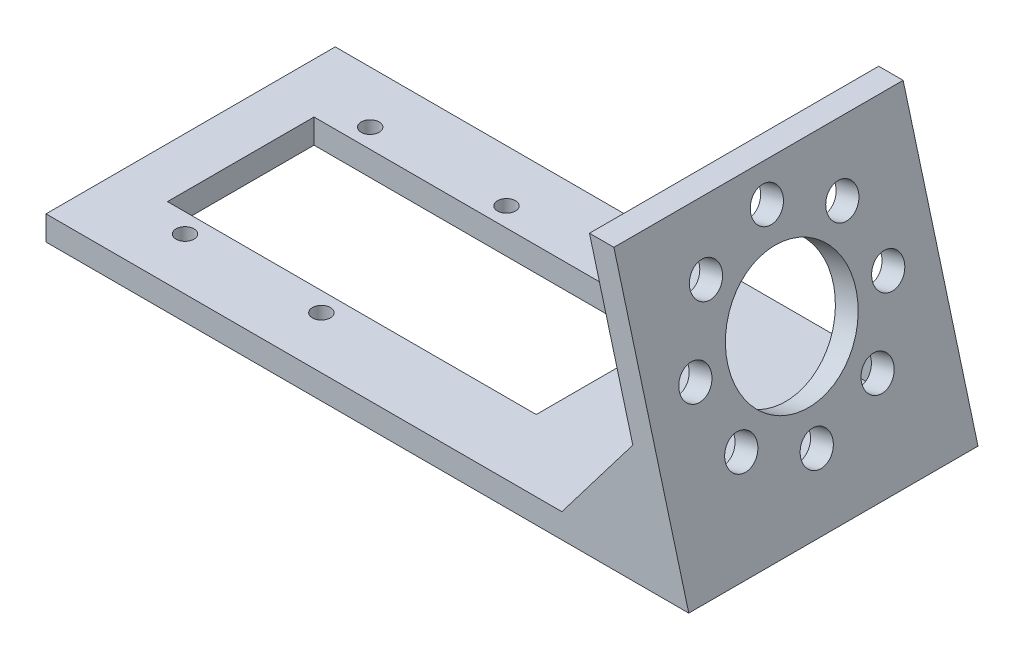
ISO-10303-21;
HEADER;
FILE_DESCRIPTION(('STEP AP214'),'2;1');
FILE_NAME('part.step','',(''),(''),'','','');
FILE_SCHEMA(('AUTOMOTIVE_DESIGN { 1 0 10303 214 1 1 1 1 }'));
ENDSEC;
DATA;
#1=APPLICATION_CONTEXT('core data for automotive mechanical design processes');
#2=APPLICATION_PROTOCOL_DEFINITION('international standard','automotive_design',2000,#1);
#3=PRODUCT_CONTEXT('',#1,'mechanical');
#4=PRODUCT('Part','Part','',(#3));
#5=PRODUCT_RELATED_PRODUCT_CATEGORY('part','',(#4));
#6=PRODUCT_DEFINITION_FORMATION('','',#4);
#7=PRODUCT_DEFINITION_CONTEXT('part definition',#1,'design');
#8=PRODUCT_DEFINITION('design','',#6,#7);
#9=PRODUCT_DEFINITION_SHAPE('','',#8);
#10=(LENGTH_UNIT() NAMED_UNIT(*) SI_UNIT(.MILLI.,.METRE.));
#11=(NAMED_UNIT(*) PLANE_ANGLE_UNIT() SI_UNIT($,.RADIAN.));
#12=(NAMED_UNIT(*) SI_UNIT($,.STERADIAN.) SOLID_ANGLE_UNIT());
#13=UNCERTAINTY_MEASURE_WITH_UNIT(LENGTH_MEASURE(1.E-05),#10,'distance_accuracy_value','');
#14=(GEOMETRIC_REPRESENTATION_CONTEXT(3) GLOBAL_UNCERTAINTY_ASSIGNED_CONTEXT((#13)) GLOBAL_UNIT_ASSIGNED_CONTEXT((#10,
#11,#12)) REPRESENTATION_CONTEXT('',''));
#15=CARTESIAN_POINT('',(0.,0.,0.));
#16=DIRECTION('',(0.,0.,1.));
#17=DIRECTION('',(1.,0.,0.));
#18=AXIS2_PLACEMENT_3D('',#15,#16,#17);
#19=CARTESIAN_POINT('',(57.6024915723907,55.2026609724202,57.15));
#20=DIRECTION('',(0.965925826289067,0.258819045102525,0.));
#21=DIRECTION('',(-0.258819045102525,0.965925826289067,0.));
#22=AXIS2_PLACEMENT_3D('',#19,#20,#21);
#23=PLANE('',#22);
#24=CARTESIAN_POINT('',(64.499776018663,29.4616449846778,47.625));
#25=DIRECTION('',(0.965925826289067,0.258819045102525,0.));
#26=DIRECTION('',(0.,0.,1.));
#27=AXIS2_PLACEMENT_3D('',#24,#25,#26);
#28=CIRCLE('',#27,3.175);
#29=CARTESIAN_POINT('',(64.499776018663,29.4616449846778,50.8));
#30=VERTEX_POINT('',#29);
#31=EDGE_CURVE('E208',#30,#30,#28,.F.);
#32=ORIENTED_EDGE('',*,*,#31,.F.);
#33=EDGE_LOOP('',(#32));
#34=FACE_BOUND('',#33,.T.);
#35=CARTESIAN_POINT('',(67.9861679897098,16.4502530136311,42.0453841816037));
#36=DIRECTION('',(0.965925826289067,0.258819045102526,0.));
#37=DIRECTION('',(0.183012701892224,-0.683012701892222,0.707106781186544));
#38=AXIS2_PLACEMENT_3D('',#35,#36,#37);
#39=CIRCLE('',#38,3.175);
#40=CARTESIAN_POINT('',(68.5672333182176,14.2816876851233,44.2904482118709));
#41=VERTEX_POINT('',#40);
#42=EDGE_CURVE('E209',#41,#41,#39,.F.);
#43=ORIENTED_EDGE('',*,*,#42,.F.);
#44=EDGE_LOOP('',(#43));
#45=FACE_BOUND('',#44,.T.);
#46=CARTESIAN_POINT('',(69.4302788278661,11.0607579938712,28.575));
#47=DIRECTION('',(0.965925826289067,0.258819045102526,0.));
#48=DIRECTION('',(0.258819045102526,-0.965925826289067,0.));
#49=AXIS2_PLACEMENT_3D('',#46,#47,#48);
#50=CIRCLE('',#49,3.175);
#51=CARTESIAN_POINT('',(70.2520292960666,7.99394349540337,28.575));
#52=VERTEX_POINT('',#51);
#53=EDGE_CURVE('E216',#52,#52,#50,.F.);
#54=ORIENTED_EDGE('',*,*,#53,.F.);
#55=EDGE_LOOP('',(#54));
#56=FACE_BOUND('',#55,.T.);
#57=CARTESIAN_POINT('',(67.9861679897098,16.4502530136312,15.1046158183961));
#58=DIRECTION('',(0.965925826289067,0.258819045102526,0.));
#59=DIRECTION('',(0.183012701892221,-0.683012701892212,-0.707106781186554));
#60=AXIS2_PLACEMENT_3D('',#57,#58,#59);
#61=CIRCLE('',#60,3.175);
#62=CARTESIAN_POINT('',(68.5672333182176,14.2816876851235,12.8595517881288));
#63=VERTEX_POINT('',#62);
#64=EDGE_CURVE('E222',#63,#63,#61,.F.);
#65=ORIENTED_EDGE('',*,*,#64,.F.);
#66=EDGE_LOOP('',(#65));
#67=FACE_BOUND('',#66,.T.);
#68=CARTESIAN_POINT('',(64.4997760186629,29.4616449846781,9.52499999999998));
#69=DIRECTION('',(0.965925826289067,0.258819045102525,0.));
#70=DIRECTION('',(0.,0.,-1.));
#71=AXIS2_PLACEMENT_3D('',#68,#69,#70);
#72=CIRCLE('',#71,3.175);
#73=CARTESIAN_POINT('',(64.4997760186629,29.4616449846781,6.34999999999998));
#74=VERTEX_POINT('',#73);
#75=EDGE_CURVE('E196',#74,#74,#72,.F.);
#76=ORIENTED_EDGE('',*,*,#75,.F.);
#77=EDGE_LOOP('',(#76));
#78=FACE_BOUND('',#77,.T.);
#79=CARTESIAN_POINT('',(61.0133840476161,42.4730369557248,15.1046158183964));
#80=DIRECTION('',(0.965925826289067,0.258819045102525,0.));
#81=DIRECTION('',(-0.183012701892224,0.683012701892227,-0.707106781186539));
#82=AXIS2_PLACEMENT_3D('',#79,#80,#81);
#83=CIRCLE('',#82,3.175);
#84=CARTESIAN_POINT('',(60.4323187191083,44.6416022842326,12.8595517881292));
#85=VERTEX_POINT('',#84);
#86=EDGE_CURVE('E197',#85,#85,#83,.F.);
#87=ORIENTED_EDGE('',*,*,#86,.F.);
#88=EDGE_LOOP('',(#87));
#89=FACE_BOUND('',#88,.T.);
#90=CARTESIAN_POINT('',(61.0133840476161,42.4730369557246,42.0453841816038));
#91=DIRECTION('',(0.965925826289067,0.258819045102525,0.));
#92=DIRECTION('',(-0.183012701892222,0.683012701892218,0.707106781186549));
#93=AXIS2_PLACEMENT_3D('',#90,#91,#92);
#94=CIRCLE('',#93,3.175);
#95=CARTESIAN_POINT('',(60.4323187191083,44.6416022842324,44.2904482118711));
#96=VERTEX_POINT('',#95);
#97=EDGE_CURVE('E231',#96,#96,#94,.F.);
#98=ORIENTED_EDGE('',*,*,#97,.F.);
#99=EDGE_LOOP('',(#98));
#100=FACE_BOUND('',#99,.T.);
#101=CARTESIAN_POINT('',(59.5692732094599,47.8625319754846,28.575));
#102=DIRECTION('',(0.965925826289067,0.258819045102525,0.));
#103=DIRECTION('',(-0.258819045102525,0.965925826289067,0.));
#104=AXIS2_PLACEMENT_3D('',#101,#102,#103);
#105=CIRCLE('',#104,3.175);
#106=CARTESIAN_POINT('',(58.7475227412593,50.9293464739524,28.575));
#107=VERTEX_POINT('',#106);
#108=EDGE_CURVE('E237',#107,#107,#105,.F.);
#109=ORIENTED_EDGE('',*,*,#108,.F.);
#110=EDGE_LOOP('',(#109));
#111=FACE_BOUND('',#110,.T.);
#112=CARTESIAN_POINT('',(64.499776018663,29.4616449846779,28.575));
#113=DIRECTION('',(0.965925826289067,0.258819045102525,0.));
#114=DIRECTION('',(-0.258819045102525,0.965925826289067,0.));
#115=AXIS2_PLACEMENT_3D('',#112,#113,#114);
#116=CIRCLE('',#115,12.7);
#117=CARTESIAN_POINT('',(61.2127741458609,41.7289029785491,28.575));
#118=VERTEX_POINT('',#117);
#119=EDGE_CURVE('E241',#118,#118,#116,.F.);
#120=ORIENTED_EDGE('',*,*,#119,.F.);
#121=EDGE_LOOP('',(#120));
#122=FACE_BOUND('',#121,.T.);
#123=DIRECTION('',(0.258819045102525,-0.965925826289067,0.));
#124=VECTOR('',#123,1.);
#125=CARTESIAN_POINT('',(57.6024915723907,55.2026609724202,0.));
#126=LINE('',#125,#124);
#127=CARTESIAN_POINT('',(57.6024915723907,55.2026609724202,0.));
#128=VERTEX_POINT('',#127);
#129=CARTESIAN_POINT('',(66.1703743881243,23.2268869908067,0.));
#130=VERTEX_POINT('',#129);
#131=EDGE_CURVE('E300',#128,#130,#126,.T.);
#132=ORIENTED_EDGE('',*,*,#131,.T.);
#133=DIRECTION('',(0.,0.,-1.));
#134=VECTOR('',#133,1.);
#135=CARTESIAN_POINT('',(66.1703743881243,23.2268869908067,4.82600000000001));
#136=LINE('',#135,#134);
#137=CARTESIAN_POINT('',(66.1703743881243,23.2268869908067,4.82600000000001));
#138=VERTEX_POINT('',#137);
#139=EDGE_CURVE('E254',#138,#130,#136,.T.);
#140=ORIENTED_EDGE('',*,*,#139,.F.);
#141=DIRECTION('',(0.258819045102525,-0.965925826289067,0.));
#142=VECTOR('',#141,1.);
#143=CARTESIAN_POINT('',(67.5445215407852,18.0985000000003,4.82600000000001));
#144=LINE('',#143,#142);
#145=CARTESIAN_POINT('',(71.1008771973273,4.826,4.82600000000001));
#146=VERTEX_POINT('',#145);
#147=EDGE_CURVE('E250',#138,#146,#144,.T.);
#148=ORIENTED_EDGE('',*,*,#147,.T.);
#149=DIRECTION('',(0.,0.,-1.));
#150=VECTOR('',#149,1.);
#151=CARTESIAN_POINT('',(71.1008771973273,4.826,57.15));
#152=LINE('',#151,#150);
#153=CARTESIAN_POINT('',(71.1008771973273,4.826,52.324));
#154=VERTEX_POINT('',#153);
#155=EDGE_CURVE('E305',#154,#146,#152,.T.);
#156=ORIENTED_EDGE('',*,*,#155,.F.);
#157=DIRECTION('',(0.258819045102525,-0.965925826289067,0.));
#158=VECTOR('',#157,1.);
#159=CARTESIAN_POINT('',(67.5445215407852,18.0985000000003,52.324));
#160=LINE('',#159,#158);
#161=CARTESIAN_POINT('',(66.1703743881243,23.2268869908068,52.324));
#162=VERTEX_POINT('',#161);
#163=EDGE_CURVE('E266',#162,#154,#160,.T.);
#164=ORIENTED_EDGE('',*,*,#163,.F.);
#165=DIRECTION('',(0.,0.,1.));
#166=VECTOR('',#165,1.);
#167=CARTESIAN_POINT('',(66.1703743881243,23.2268869908068,52.324));
#168=LINE('',#167,#166);
#169=CARTESIAN_POINT('',(66.1703743881243,23.2268869908068,57.15));
#170=VERTEX_POINT('',#169);
#171=EDGE_CURVE('E270',#162,#170,#168,.T.);
#172=ORIENTED_EDGE('',*,*,#171,.T.);
#173=DIRECTION('',(0.258819045102525,-0.965925826289067,0.));
#174=VECTOR('',#173,1.);
#175=CARTESIAN_POINT('',(57.6024915723907,55.2026609724202,57.15));
#176=LINE('',#175,#174);
#177=CARTESIAN_POINT('',(57.6024915723907,55.2026609724202,57.15));
#178=VERTEX_POINT('',#177);
#179=EDGE_CURVE('E286',#178,#170,#176,.T.);
#180=ORIENTED_EDGE('',*,*,#179,.F.);
#181=DIRECTION('',(0.,0.,-1.));
#182=VECTOR('',#181,1.);
#183=CARTESIAN_POINT('',(57.6024915723907,55.2026609724202,57.15));
#184=LINE('',#183,#182);
#185=EDGE_CURVE('E308',#178,#128,#184,.T.);
#186=ORIENTED_EDGE('',*,*,#185,.T.);
#187=EDGE_LOOP('',(#132,#140,#148,#156,#164,#172,#180,#186));
#188=FACE_BOUND('',#187,.T.);
#189=ADVANCED_FACE('F39',(#34,#45,#56,#67,#78,#89,#100,#111,#122,#188),#23,.F.);
#190=CARTESIAN_POINT('',(71.1008771973273,4.826,57.15));
#191=DIRECTION('',(0.,-1.,0.));
#192=DIRECTION('',(1.,0.,0.));
#193=AXIS2_PLACEMENT_3D('',#190,#191,#192);
#194=PLANE('',#193);
#195=CARTESIAN_POINT('',(-32.595884,4.826,10.287));
#196=DIRECTION('',(0.,-1.,0.));
#197=DIRECTION('',(-1.,0.,0.));
#198=AXIS2_PLACEMENT_3D('',#195,#196,#197);
#199=CIRCLE('',#198,1.778);
#200=CARTESIAN_POINT('',(-34.373884,4.826,10.287));
#201=VERTEX_POINT('',#200);
#202=EDGE_CURVE('E397',#201,#201,#199,.T.);
#203=ORIENTED_EDGE('',*,*,#202,.T.);
#204=EDGE_LOOP('',(#203));
#205=FACE_BOUND('',#204,.T.);
#206=CARTESIAN_POINT('',(-5.65512000000001,4.826,10.287));
#207=DIRECTION('',(0.,-1.,0.));
#208=DIRECTION('',(-1.,0.,0.));
#209=AXIS2_PLACEMENT_3D('',#206,#207,#208);
#210=CIRCLE('',#209,1.778);
#211=CARTESIAN_POINT('',(-7.43312000000001,4.826,10.287));
#212=VERTEX_POINT('',#211);
#213=EDGE_CURVE('E164',#212,#212,#210,.T.);
#214=ORIENTED_EDGE('',*,*,#213,.T.);
#215=EDGE_LOOP('',(#214));
#216=FACE_BOUND('',#215,.T.);
#217=DIRECTION('',(0.,0.,1.));
#218=VECTOR('',#217,1.);
#219=CARTESIAN_POINT('',(-39.874,4.826,43.053));
#220=LINE('',#219,#218);
#221=CARTESIAN_POINT('',(-39.874,4.826,14.097));
#222=VERTEX_POINT('',#221);
#223=CARTESIAN_POINT('',(-39.874,4.826,43.053));
#224=VERTEX_POINT('',#223);
#225=EDGE_CURVE('E170',#222,#224,#220,.T.);
#226=ORIENTED_EDGE('',*,*,#225,.F.);
#227=DIRECTION('',(-1.,0.,0.));
#228=VECTOR('',#227,1.);
#229=CARTESIAN_POINT('',(-39.874,4.826,14.097));
#230=LINE('',#229,#228);
#231=CARTESIAN_POINT('',(32.98844,4.826,14.097));
#232=VERTEX_POINT('',#231);
#233=EDGE_CURVE('E54',#232,#222,#230,.T.);
#234=ORIENTED_EDGE('',*,*,#233,.F.);
#235=DIRECTION('',(0.,0.,-1.));
#236=VECTOR('',#235,1.);
#237=CARTESIAN_POINT('',(32.98844,4.826,14.097));
#238=LINE('',#237,#236);
#239=CARTESIAN_POINT('',(32.98844,4.826,43.053));
#240=VERTEX_POINT('',#239);
#241=EDGE_CURVE('E158',#240,#232,#238,.T.);
#242=ORIENTED_EDGE('',*,*,#241,.F.);
#243=DIRECTION('',(1.,0.,0.));
#244=VECTOR('',#243,1.);
#245=CARTESIAN_POINT('',(-39.874,4.826,43.053));
#246=LINE('',#245,#244);
#247=EDGE_CURVE('E161',#224,#240,#246,.T.);
#248=ORIENTED_EDGE('',*,*,#247,.F.);
#249=EDGE_LOOP('',(#226,#234,#242,#248));
#250=FACE_BOUND('',#249,.T.);
#251=CARTESIAN_POINT('',(-32.595884,4.826,46.863));
#252=DIRECTION('',(0.,1.,0.));
#253=DIRECTION('',(-1.,0.,0.));
#254=AXIS2_PLACEMENT_3D('',#251,#252,#253);
#255=CIRCLE('',#254,1.778);
#256=CARTESIAN_POINT('',(-34.373884,4.826,46.863));
#257=VERTEX_POINT('',#256);
#258=EDGE_CURVE('E183',#257,#257,#255,.T.);
#259=ORIENTED_EDGE('',*,*,#258,.F.);
#260=EDGE_LOOP('',(#259));
#261=FACE_BOUND('',#260,.T.);
#262=CARTESIAN_POINT('',(-5.65512000000001,4.826,46.863));
#263=DIRECTION('',(0.,1.,0.));
#264=DIRECTION('',(-1.,0.,0.));
#265=AXIS2_PLACEMENT_3D('',#262,#263,#264);
#266=CIRCLE('',#265,1.778);
#267=CARTESIAN_POINT('',(-7.43312000000001,4.826,46.863));
#268=VERTEX_POINT('',#267);
#269=EDGE_CURVE('E189',#268,#268,#266,.T.);
#270=ORIENTED_EDGE('',*,*,#269,.F.);
#271=EDGE_LOOP('',(#270));
#272=FACE_BOUND('',#271,.T.);
#273=DIRECTION('',(-1.,0.,0.));
#274=VECTOR('',#273,1.);
#275=CARTESIAN_POINT('',(0.,4.826,4.82600000000001));
#276=LINE('',#275,#274);
#277=CARTESIAN_POINT('',(52.1482550347823,4.826,4.82600000000001));
#278=VERTEX_POINT('',#277);
#279=EDGE_CURVE('E252',#146,#278,#276,.T.);
#280=ORIENTED_EDGE('',*,*,#279,.T.);
#281=DIRECTION('',(0.,0.,-1.));
#282=VECTOR('',#281,1.);
#283=CARTESIAN_POINT('',(52.1482550347823,4.826,4.82600000000001));
#284=LINE('',#283,#282);
#285=CARTESIAN_POINT('',(52.1482550347823,4.826,0.));
#286=VERTEX_POINT('',#285);
#287=EDGE_CURVE('E257',#278,#286,#284,.T.);
#288=ORIENTED_EDGE('',*,*,#287,.T.);
#289=DIRECTION('',(-1.,0.,0.));
#290=VECTOR('',#289,1.);
#291=CARTESIAN_POINT('',(71.1008771973273,4.826,0.));
#292=LINE('',#291,#290);
#293=CARTESIAN_POINT('',(-49.78,4.826,0.));
#294=VERTEX_POINT('',#293);
#295=EDGE_CURVE('E280',#286,#294,#292,.T.);
#296=ORIENTED_EDGE('',*,*,#295,.T.);
#297=DIRECTION('',(0.,0.,-1.));
#298=VECTOR('',#297,1.);
#299=CARTESIAN_POINT('',(-49.78,4.826,57.15));
#300=LINE('',#299,#298);
#301=CARTESIAN_POINT('',(-49.78,4.826,57.15));
#302=VERTEX_POINT('',#301);
#303=EDGE_CURVE('E291',#302,#294,#300,.T.);
#304=ORIENTED_EDGE('',*,*,#303,.F.);
#305=DIRECTION('',(-1.,0.,0.));
#306=VECTOR('',#305,1.);
#307=CARTESIAN_POINT('',(71.1008771973273,4.826,57.15));
#308=LINE('',#307,#306);
#309=CARTESIAN_POINT('',(52.1482550347823,4.826,57.15));
#310=VERTEX_POINT('',#309);
#311=EDGE_CURVE('E289',#310,#302,#308,.T.);
#312=ORIENTED_EDGE('',*,*,#311,.F.);
#313=DIRECTION('',(0.,0.,1.));
#314=VECTOR('',#313,1.);
#315=CARTESIAN_POINT('',(52.1482550347823,4.826,52.324));
#316=LINE('',#315,#314);
#317=CARTESIAN_POINT('',(52.1482550347823,4.826,52.324));
#318=VERTEX_POINT('',#317);
#319=EDGE_CURVE('E268',#318,#310,#316,.T.);
#320=ORIENTED_EDGE('',*,*,#319,.F.);
#321=DIRECTION('',(-1.,0.,0.));
#322=VECTOR('',#321,1.);
#323=CARTESIAN_POINT('',(0.,4.826,52.324));
#324=LINE('',#323,#322);
#325=EDGE_CURVE('E264',#154,#318,#324,.T.);
#326=ORIENTED_EDGE('',*,*,#325,.F.);
#327=ORIENTED_EDGE('',*,*,#155,.T.);
#328=EDGE_LOOP('',(#280,#288,#296,#304,#312,#320,#326,#327));
#329=FACE_BOUND('',#328,.T.);
#330=ADVANCED_FACE('F352',(#205,#216,#250,#261,#272,#329),#194,.F.);
#331=CARTESIAN_POINT('',(-49.78,4.826,57.15));
#332=DIRECTION('',(1.,0.,0.));
#333=DIRECTION('',(0.,0.,-1.));
#334=AXIS2_PLACEMENT_3D('',#331,#332,#333);
#335=PLANE('',#334);
#336=DIRECTION('',(0.,-1.,0.));
#337=VECTOR('',#336,1.);
#338=CARTESIAN_POINT('',(-49.78,4.826,0.));
#339=LINE('',#338,#337);
#340=CARTESIAN_POINT('',(-49.78,0.,0.));
#341=VERTEX_POINT('',#340);
#342=EDGE_CURVE('E273',#294,#341,#339,.T.);
#343=ORIENTED_EDGE('',*,*,#342,.T.);
#344=DIRECTION('',(0.,0.,-1.));
#345=VECTOR('',#344,1.);
#346=CARTESIAN_POINT('',(-49.78,0.,57.15));
#347=LINE('',#346,#345);
#348=CARTESIAN_POINT('',(-49.78,0.,57.15));
#349=VERTEX_POINT('',#348);
#350=EDGE_CURVE('E11',#349,#341,#347,.T.);
#351=ORIENTED_EDGE('',*,*,#350,.F.);
#352=DIRECTION('',(0.,-1.,0.));
#353=VECTOR('',#352,1.);
#354=CARTESIAN_POINT('',(-49.78,4.826,57.15));
#355=LINE('',#354,#353);
#356=EDGE_CURVE('E276',#302,#349,#355,.T.);
#357=ORIENTED_EDGE('',*,*,#356,.F.);
#358=ORIENTED_EDGE('',*,*,#303,.T.);
#359=EDGE_LOOP('',(#343,#351,#357,#358));
#360=FACE_BOUND('',#359,.T.);
#361=ADVANCED_FACE('F41',(#360),#335,.F.);
#362=CARTESIAN_POINT('',(-49.78,0.,57.15));
#363=DIRECTION('',(0.,1.,0.));
#364=DIRECTION('',(0.,0.,1.));
#365=AXIS2_PLACEMENT_3D('',#362,#363,#364);
#366=PLANE('',#365);
#367=CARTESIAN_POINT('',(-32.595884,0.,10.287));
#368=DIRECTION('',(0.,-1.,0.));
#369=DIRECTION('',(-1.,0.,0.));
#370=AXIS2_PLACEMENT_3D('',#367,#368,#369);
#371=CIRCLE('',#370,1.778);
#372=CARTESIAN_POINT('',(-34.373884,0.,10.287));
#373=VERTEX_POINT('',#372);
#374=EDGE_CURVE('E192',#373,#373,#371,.T.);
#375=ORIENTED_EDGE('',*,*,#374,.F.);
#376=EDGE_LOOP('',(#375));
#377=FACE_BOUND('',#376,.T.);
#378=CARTESIAN_POINT('',(-5.65512000000001,0.,10.287));
#379=DIRECTION('',(0.,-1.,0.));
#380=DIRECTION('',(-1.,0.,0.));
#381=AXIS2_PLACEMENT_3D('',#378,#379,#380);
#382=CIRCLE('',#381,1.778);
#383=CARTESIAN_POINT('',(-7.43312000000001,0.,10.287));
#384=VERTEX_POINT('',#383);
#385=EDGE_CURVE('E395',#384,#384,#382,.T.);
#386=ORIENTED_EDGE('',*,*,#385,.F.);
#387=EDGE_LOOP('',(#386));
#388=FACE_BOUND('',#387,.T.);
#389=DIRECTION('',(0.,0.,-1.));
#390=VECTOR('',#389,1.);
#391=CARTESIAN_POINT('',(32.98844,0.,14.097));
#392=LINE('',#391,#390);
#393=CARTESIAN_POINT('',(32.98844,0.,43.053));
#394=VERTEX_POINT('',#393);
#395=CARTESIAN_POINT('',(32.98844,0.,14.097));
#396=VERTEX_POINT('',#395);
#397=EDGE_CURVE('E148',#394,#396,#392,.T.);
#398=ORIENTED_EDGE('',*,*,#397,.T.);
#399=DIRECTION('',(-1.,0.,0.));
#400=VECTOR('',#399,1.);
#401=CARTESIAN_POINT('',(-39.874,0.,14.097));
#402=LINE('',#401,#400);
#403=CARTESIAN_POINT('',(-39.874,0.,14.097));
#404=VERTEX_POINT('',#403);
#405=EDGE_CURVE('E142',#396,#404,#402,.T.);
#406=ORIENTED_EDGE('',*,*,#405,.T.);
#407=DIRECTION('',(0.,0.,1.));
#408=VECTOR('',#407,1.);
#409=CARTESIAN_POINT('',(-39.874,0.,43.053));
#410=LINE('',#409,#408);
#411=CARTESIAN_POINT('',(-39.874,0.,43.053));
#412=VERTEX_POINT('',#411);
#413=EDGE_CURVE('E151',#404,#412,#410,.T.);
#414=ORIENTED_EDGE('',*,*,#413,.T.);
#415=DIRECTION('',(1.,0.,0.));
#416=VECTOR('',#415,1.);
#417=CARTESIAN_POINT('',(-39.874,0.,43.053));
#418=LINE('',#417,#416);
#419=EDGE_CURVE('E62',#412,#394,#418,.T.);
#420=ORIENTED_EDGE('',*,*,#419,.T.);
#421=EDGE_LOOP('',(#398,#406,#414,#420));
#422=FACE_BOUND('',#421,.T.);
#423=CARTESIAN_POINT('',(-32.595884,0.,46.863));
#424=DIRECTION('',(0.,1.,0.));
#425=DIRECTION('',(-1.,0.,0.));
#426=AXIS2_PLACEMENT_3D('',#423,#424,#425);
#427=CIRCLE('',#426,1.778);
#428=CARTESIAN_POINT('',(-34.373884,0.,46.863));
#429=VERTEX_POINT('',#428);
#430=EDGE_CURVE('E171',#429,#429,#427,.T.);
#431=ORIENTED_EDGE('',*,*,#430,.T.);
#432=EDGE_LOOP('',(#431));
#433=FACE_BOUND('',#432,.T.);
#434=CARTESIAN_POINT('',(-5.65512000000001,0.,46.863));
#435=DIRECTION('',(0.,1.,0.));
#436=DIRECTION('',(-1.,0.,0.));
#437=AXIS2_PLACEMENT_3D('',#434,#435,#436);
#438=CIRCLE('',#437,1.778);
#439=CARTESIAN_POINT('',(-7.43312000000001,0.,46.863));
#440=VERTEX_POINT('',#439);
#441=EDGE_CURVE('E186',#440,#440,#438,.T.);
#442=ORIENTED_EDGE('',*,*,#441,.T.);
#443=EDGE_LOOP('',(#442));
#444=FACE_BOUND('',#443,.T.);
#445=DIRECTION('',(1.,0.,0.));
#446=VECTOR('',#445,1.);
#447=CARTESIAN_POINT('',(-49.78,0.,0.));
#448=LINE('',#447,#446);
#449=CARTESIAN_POINT('',(77.22,0.,0.));
#450=VERTEX_POINT('',#449);
#451=EDGE_CURVE('E294',#341,#450,#448,.T.);
#452=ORIENTED_EDGE('',*,*,#451,.T.);
#453=DIRECTION('',(0.,0.,-1.));
#454=VECTOR('',#453,1.);
#455=CARTESIAN_POINT('',(77.22,0.,57.15));
#456=LINE('',#455,#454);
#457=CARTESIAN_POINT('',(77.22,0.,57.15));
#458=VERTEX_POINT('',#457);
#459=EDGE_CURVE('E47',#458,#450,#456,.T.);
#460=ORIENTED_EDGE('',*,*,#459,.F.);
#461=DIRECTION('',(1.,0.,0.));
#462=VECTOR('',#461,1.);
#463=CARTESIAN_POINT('',(-49.78,0.,57.15));
#464=LINE('',#463,#462);
#465=EDGE_CURVE('E279',#349,#458,#464,.T.);
#466=ORIENTED_EDGE('',*,*,#465,.F.);
#467=ORIENTED_EDGE('',*,*,#350,.T.);
#468=EDGE_LOOP('',(#452,#460,#466,#467));
#469=FACE_BOUND('',#468,.T.);
#470=ADVANCED_FACE('F155',(#377,#388,#422,#433,#444,#469),#366,.F.);
#471=CARTESIAN_POINT('',(77.22,0.,57.15));
#472=DIRECTION('',(-0.965925826289067,-0.258819045102525,0.));
#473=DIRECTION('',(0.258819045102525,-0.965925826289067,0.));
#474=AXIS2_PLACEMENT_3D('',#471,#472,#473);
#475=PLANE('',#474);
#476=CARTESIAN_POINT('',(69.0024953179949,30.6681449846779,47.625));
#477=DIRECTION('',(0.965925826289067,0.258819045102525,0.));
#478=DIRECTION('',(0.,0.,1.));
#479=AXIS2_PLACEMENT_3D('',#476,#477,#478);
#480=CIRCLE('',#479,3.175);
#481=CARTESIAN_POINT('',(69.0024953179949,30.6681449846779,50.8));
#482=VERTEX_POINT('',#481);
#483=EDGE_CURVE('E205',#482,#482,#480,.T.);
#484=ORIENTED_EDGE('',*,*,#483,.F.);
#485=EDGE_LOOP('',(#484));
#486=FACE_BOUND('',#485,.T.);
#487=CARTESIAN_POINT('',(72.4888872890417,17.6567530136311,42.0453841816037));
#488=DIRECTION('',(0.965925826289067,0.258819045102525,0.));
#489=DIRECTION('',(0.183012701892224,-0.683012701892222,0.707106781186544));
#490=AXIS2_PLACEMENT_3D('',#487,#488,#489);
#491=CIRCLE('',#490,3.175);
#492=CARTESIAN_POINT('',(73.0699526175495,15.4881876851233,44.2904482118709));
#493=VERTEX_POINT('',#492);
#494=EDGE_CURVE('E213',#493,#493,#491,.T.);
#495=ORIENTED_EDGE('',*,*,#494,.F.);
#496=EDGE_LOOP('',(#495));
#497=FACE_BOUND('',#496,.T.);
#498=CARTESIAN_POINT('',(73.932998127198,12.2672579938712,28.575));
#499=DIRECTION('',(0.965925826289067,0.258819045102525,0.));
#500=DIRECTION('',(0.258819045102526,-0.965925826289068,0.));
#501=AXIS2_PLACEMENT_3D('',#498,#499,#500);
#502=CIRCLE('',#501,3.175);
#503=CARTESIAN_POINT('',(74.7547485953985,9.2004434954034,28.575));
#504=VERTEX_POINT('',#503);
#505=EDGE_CURVE('E219',#504,#504,#502,.T.);
#506=ORIENTED_EDGE('',*,*,#505,.F.);
#507=EDGE_LOOP('',(#506));
#508=FACE_BOUND('',#507,.T.);
#509=CARTESIAN_POINT('',(72.4888872890417,17.6567530136313,15.1046158183961));
#510=DIRECTION('',(0.965925826289067,0.258819045102525,0.));
#511=DIRECTION('',(0.183012701892221,-0.683012701892213,-0.707106781186554));
#512=AXIS2_PLACEMENT_3D('',#509,#510,#511);
#513=CIRCLE('',#512,3.175);
#514=CARTESIAN_POINT('',(73.0699526175495,15.4881876851235,12.8595517881288));
#515=VERTEX_POINT('',#514);
#516=EDGE_CURVE('E200',#515,#515,#513,.T.);
#517=ORIENTED_EDGE('',*,*,#516,.F.);
#518=EDGE_LOOP('',(#517));
#519=FACE_BOUND('',#518,.T.);
#520=CARTESIAN_POINT('',(69.0024953179948,30.6681449846781,9.52499999999998));
#521=DIRECTION('',(0.965925826289067,0.258819045102525,0.));
#522=DIRECTION('',(0.,0.,-1.));
#523=AXIS2_PLACEMENT_3D('',#520,#521,#522);
#524=CIRCLE('',#523,3.175);
#525=CARTESIAN_POINT('',(69.0024953179948,30.6681449846782,6.34999999999998));
#526=VERTEX_POINT('',#525);
#527=EDGE_CURVE('E193',#526,#526,#524,.T.);
#528=ORIENTED_EDGE('',*,*,#527,.F.);
#529=EDGE_LOOP('',(#528));
#530=FACE_BOUND('',#529,.T.);
#531=CARTESIAN_POINT('',(65.516103346948,43.6795369557249,15.1046158183964));
#532=DIRECTION('',(0.965925826289067,0.258819045102525,0.));
#533=DIRECTION('',(-0.183012701892225,0.683012701892227,-0.707106781186539));
#534=AXIS2_PLACEMENT_3D('',#531,#532,#533);
#535=CIRCLE('',#534,3.175);
#536=CARTESIAN_POINT('',(64.9350380184402,45.8481022842327,12.8595517881292));
#537=VERTEX_POINT('',#536);
#538=EDGE_CURVE('E177',#537,#537,#535,.T.);
#539=ORIENTED_EDGE('',*,*,#538,.F.);
#540=EDGE_LOOP('',(#539));
#541=FACE_BOUND('',#540,.T.);
#542=CARTESIAN_POINT('',(65.516103346948,43.6795369557247,42.0453841816038));
#543=DIRECTION('',(0.965925826289067,0.258819045102525,0.));
#544=DIRECTION('',(-0.183012701892222,0.683012701892218,0.707106781186549));
#545=AXIS2_PLACEMENT_3D('',#542,#543,#544);
#546=CIRCLE('',#545,3.175);
#547=CARTESIAN_POINT('',(64.9350380184402,45.8481022842325,44.2904482118711));
#548=VERTEX_POINT('',#547);
#549=EDGE_CURVE('E212',#548,#548,#546,.T.);
#550=ORIENTED_EDGE('',*,*,#549,.F.);
#551=EDGE_LOOP('',(#550));
#552=FACE_BOUND('',#551,.T.);
#553=CARTESIAN_POINT('',(64.0719925087917,49.0690319754847,28.575));
#554=DIRECTION('',(0.965925826289067,0.258819045102525,0.));
#555=DIRECTION('',(-0.258819045102525,0.965925826289067,0.));
#556=AXIS2_PLACEMENT_3D('',#553,#554,#555);
#557=CIRCLE('',#556,3.175);
#558=CARTESIAN_POINT('',(63.2502420405912,52.1358464739525,28.575));
#559=VERTEX_POINT('',#558);
#560=EDGE_CURVE('E234',#559,#559,#557,.T.);
#561=ORIENTED_EDGE('',*,*,#560,.F.);
#562=EDGE_LOOP('',(#561));
#563=FACE_BOUND('',#562,.T.);
#564=CARTESIAN_POINT('',(69.0024953179949,30.6681449846779,28.575));
#565=DIRECTION('',(0.965925826289067,0.258819045102525,0.));
#566=DIRECTION('',(-0.258819045102525,0.965925826289067,0.));
#567=AXIS2_PLACEMENT_3D('',#564,#565,#566);
#568=CIRCLE('',#567,12.7);
#569=CARTESIAN_POINT('',(65.7154934451928,42.9354029785491,28.575));
#570=VERTEX_POINT('',#569);
#571=EDGE_CURVE('E240',#570,#570,#568,.T.);
#572=ORIENTED_EDGE('',*,*,#571,.F.);
#573=EDGE_LOOP('',(#572));
#574=FACE_BOUND('',#573,.T.);
#575=DIRECTION('',(-0.258819045102525,0.965925826289067,0.));
#576=VECTOR('',#575,1.);
#577=CARTESIAN_POINT('',(77.22,0.,0.));
#578=LINE('',#577,#576);
#579=CARTESIAN_POINT('',(62.4284915723907,55.2026609724202,0.));
#580=VERTEX_POINT('',#579);
#581=EDGE_CURVE('E296',#450,#580,#578,.T.);
#582=ORIENTED_EDGE('',*,*,#581,.T.);
#583=DIRECTION('',(0.,0.,-1.));
#584=VECTOR('',#583,1.);
#585=CARTESIAN_POINT('',(62.4284915723907,55.2026609724202,57.15));
#586=LINE('',#585,#584);
#587=CARTESIAN_POINT('',(62.4284915723907,55.2026609724202,57.15));
#588=VERTEX_POINT('',#587);
#589=EDGE_CURVE('E311',#588,#580,#586,.T.);
#590=ORIENTED_EDGE('',*,*,#589,.F.);
#591=DIRECTION('',(-0.258819045102525,0.965925826289067,0.));
#592=VECTOR('',#591,1.);
#593=CARTESIAN_POINT('',(77.22,0.,57.15));
#594=LINE('',#593,#592);
#595=EDGE_CURVE('E282',#458,#588,#594,.T.);
#596=ORIENTED_EDGE('',*,*,#595,.F.);
#597=ORIENTED_EDGE('',*,*,#459,.T.);
#598=EDGE_LOOP('',(#582,#590,#596,#597));
#599=FACE_BOUND('',#598,.T.);
#600=ADVANCED_FACE('F318',(#486,#497,#508,#519,#530,#541,#552,#563,#574,#599),#475,.F.);
#601=CARTESIAN_POINT('',(62.4284915723907,55.2026609724202,57.15));
#602=DIRECTION('',(0.,-1.,0.));
#603=DIRECTION('',(1.,0.,0.));
#604=AXIS2_PLACEMENT_3D('',#601,#602,#603);
#605=PLANE('',#604);
#606=DIRECTION('',(-1.,0.,0.));
#607=VECTOR('',#606,1.);
#608=CARTESIAN_POINT('',(62.4284915723907,55.2026609724202,0.));
#609=LINE('',#608,#607);
#610=EDGE_CURVE('E298',#580,#128,#609,.T.);
#611=ORIENTED_EDGE('',*,*,#610,.T.);
#612=ORIENTED_EDGE('',*,*,#185,.F.);
#613=DIRECTION('',(-1.,0.,0.));
#614=VECTOR('',#613,1.);
#615=CARTESIAN_POINT('',(62.4284915723907,55.2026609724202,57.15));
#616=LINE('',#615,#614);
#617=EDGE_CURVE('E284',#588,#178,#616,.T.);
#618=ORIENTED_EDGE('',*,*,#617,.F.);
#619=ORIENTED_EDGE('',*,*,#589,.T.);
#620=EDGE_LOOP('',(#611,#612,#618,#619));
#621=FACE_BOUND('',#620,.T.);
#622=ADVANCED_FACE('F329',(#621),#605,.F.);
#623=CARTESIAN_POINT('',(0.,0.,57.15));
#624=DIRECTION('',(0.,0.,1.));
#625=DIRECTION('',(1.,0.,0.));
#626=AXIS2_PLACEMENT_3D('',#623,#624,#625);
#627=PLANE('',#626);
#628=ORIENTED_EDGE('',*,*,#356,.T.);
#629=ORIENTED_EDGE('',*,*,#465,.T.);
#630=ORIENTED_EDGE('',*,*,#595,.T.);
#631=ORIENTED_EDGE('',*,*,#617,.T.);
#632=ORIENTED_EDGE('',*,*,#179,.T.);
#633=DIRECTION('',(0.606108739732748,0.795381792361115,0.));
#634=VECTOR('',#633,1.);
#635=CARTESIAN_POINT('',(30.664109088417,-23.3671234281533,57.15));
#636=LINE('',#635,#634);
#637=EDGE_CURVE('E259',#310,#170,#636,.T.);
#638=ORIENTED_EDGE('',*,*,#637,.F.);
#639=ORIENTED_EDGE('',*,*,#311,.T.);
#640=EDGE_LOOP('',(#628,#629,#630,#631,#632,#638,#639));
#641=FACE_BOUND('',#640,.T.);
#642=ADVANCED_FACE('F336',(#641),#627,.T.);
#643=CARTESIAN_POINT('',(0.,0.,0.));
#644=DIRECTION('',(0.,0.,1.));
#645=DIRECTION('',(1.,0.,0.));
#646=AXIS2_PLACEMENT_3D('',#643,#644,#645);
#647=PLANE('',#646);
#648=ORIENTED_EDGE('',*,*,#295,.F.);
#649=DIRECTION('',(0.606108739732748,0.795381792361115,0.));
#650=VECTOR('',#649,1.);
#651=CARTESIAN_POINT('',(30.664109088417,-23.3671234281533,0.));
#652=LINE('',#651,#650);
#653=EDGE_CURVE('E244',#286,#130,#652,.T.);
#654=ORIENTED_EDGE('',*,*,#653,.T.);
#655=ORIENTED_EDGE('',*,*,#131,.F.);
#656=ORIENTED_EDGE('',*,*,#610,.F.);
#657=ORIENTED_EDGE('',*,*,#581,.F.);
#658=ORIENTED_EDGE('',*,*,#451,.F.);
#659=ORIENTED_EDGE('',*,*,#342,.F.);
#660=EDGE_LOOP('',(#648,#654,#655,#656,#657,#658,#659));
#661=FACE_BOUND('',#660,.T.);
#662=ADVANCED_FACE('F324',(#661),#647,.F.);
#663=CARTESIAN_POINT('',(30.664109088417,-23.3671234281533,52.324));
#664=DIRECTION('',(0.795381792361115,-0.606108739732748,0.));
#665=DIRECTION('',(0.606108739732748,0.795381792361115,0.));
#666=AXIS2_PLACEMENT_3D('',#663,#664,#665);
#667=PLANE('',#666);
#668=ORIENTED_EDGE('',*,*,#637,.T.);
#669=ORIENTED_EDGE('',*,*,#171,.F.);
#670=DIRECTION('',(0.606108739732748,0.795381792361115,0.));
#671=VECTOR('',#670,1.);
#672=CARTESIAN_POINT('',(30.664109088417,-23.3671234281533,52.324));
#673=LINE('',#672,#671);
#674=EDGE_CURVE('E262',#318,#162,#673,.T.);
#675=ORIENTED_EDGE('',*,*,#674,.F.);
#676=ORIENTED_EDGE('',*,*,#319,.T.);
#677=EDGE_LOOP('',(#668,#669,#675,#676));
#678=FACE_BOUND('',#677,.T.);
#679=ADVANCED_FACE('F359',(#678),#667,.F.);
#680=CARTESIAN_POINT('',(0.,0.,52.324));
#681=DIRECTION('',(0.,0.,1.));
#682=DIRECTION('',(1.,0.,0.));
#683=AXIS2_PLACEMENT_3D('',#680,#681,#682);
#684=PLANE('',#683);
#685=ORIENTED_EDGE('',*,*,#674,.T.);
#686=ORIENTED_EDGE('',*,*,#163,.T.);
#687=ORIENTED_EDGE('',*,*,#325,.T.);
#688=EDGE_LOOP('',(#685,#686,#687));
#689=FACE_BOUND('',#688,.T.);
#690=ADVANCED_FACE('F356',(#689),#684,.F.);
#691=CARTESIAN_POINT('',(30.664109088417,-23.3671234281533,4.82600000000002));
#692=DIRECTION('',(-0.795381792361115,0.606108739732748,0.));
#693=DIRECTION('',(-0.606108739732748,-0.795381792361115,0.));
#694=AXIS2_PLACEMENT_3D('',#691,#692,#693);
#695=PLANE('',#694);
#696=ORIENTED_EDGE('',*,*,#653,.F.);
#697=ORIENTED_EDGE('',*,*,#287,.F.);
#698=DIRECTION('',(0.606108739732748,0.795381792361115,0.));
#699=VECTOR('',#698,1.);
#700=CARTESIAN_POINT('',(30.664109088417,-23.3671234281533,4.82600000000002));
#701=LINE('',#700,#699);
#702=EDGE_CURVE('E247',#278,#138,#701,.T.);
#703=ORIENTED_EDGE('',*,*,#702,.T.);
#704=ORIENTED_EDGE('',*,*,#139,.T.);
#705=EDGE_LOOP('',(#696,#697,#703,#704));
#706=FACE_BOUND('',#705,.T.);
#707=ADVANCED_FACE('F345',(#706),#695,.T.);
#708=CARTESIAN_POINT('',(0.,0.,4.82600000000001));
#709=DIRECTION('',(0.,0.,-1.));
#710=DIRECTION('',(1.,0.,0.));
#711=AXIS2_PLACEMENT_3D('',#708,#709,#710);
#712=PLANE('',#711);
#713=ORIENTED_EDGE('',*,*,#702,.F.);
#714=ORIENTED_EDGE('',*,*,#279,.F.);
#715=ORIENTED_EDGE('',*,*,#147,.F.);
#716=EDGE_LOOP('',(#713,#714,#715));
#717=FACE_BOUND('',#716,.T.);
#718=ADVANCED_FACE('F351',(#717),#712,.F.);
#719=CARTESIAN_POINT('',(-49.4913008350186,-1.08217200262069,28.575));
#720=DIRECTION('',(0.965925826289067,0.258819045102525,0.));
#721=DIRECTION('',(-0.258819045102525,0.965925826289067,0.));
#722=AXIS2_PLACEMENT_3D('',#719,#720,#721);
#723=CYLINDRICAL_SURFACE('',#722,12.7);
#724=ORIENTED_EDGE('',*,*,#571,.T.);
#725=EDGE_LOOP('',(#724));
#726=FACE_BOUND('',#725,.T.);
#727=ORIENTED_EDGE('',*,*,#119,.T.);
#728=EDGE_LOOP('',(#727));
#729=FACE_BOUND('',#728,.T.);
#730=ADVANCED_FACE('F462',(#726,#729),#723,.F.);
#731=CARTESIAN_POINT('',(-54.4218036442217,17.3187149881861,28.575));
#732=DIRECTION('',(0.965925826289067,0.258819045102525,0.));
#733=DIRECTION('',(-0.258819045102525,0.965925826289067,0.));
#734=AXIS2_PLACEMENT_3D('',#731,#732,#733);
#735=CYLINDRICAL_SURFACE('',#734,3.175);
#736=ORIENTED_EDGE('',*,*,#560,.T.);
#737=EDGE_LOOP('',(#736));
#738=FACE_BOUND('',#737,.T.);
#739=ORIENTED_EDGE('',*,*,#108,.T.);
#740=EDGE_LOOP('',(#739));
#741=FACE_BOUND('',#740,.T.);
#742=ADVANCED_FACE('F458',(#738,#741),#735,.F.);
#743=CARTESIAN_POINT('',(-52.9776928060655,11.9292199684261,42.0453841816038));
#744=DIRECTION('',(0.965925826289067,0.258819045102525,0.));
#745=DIRECTION('',(-0.183012701892222,0.683012701892218,0.707106781186549));
#746=AXIS2_PLACEMENT_3D('',#743,#744,#745);
#747=CYLINDRICAL_SURFACE('',#746,3.175);
#748=ORIENTED_EDGE('',*,*,#549,.T.);
#749=EDGE_LOOP('',(#748));
#750=FACE_BOUND('',#749,.T.);
#751=ORIENTED_EDGE('',*,*,#97,.T.);
#752=EDGE_LOOP('',(#751));
#753=FACE_BOUND('',#752,.T.);
#754=ADVANCED_FACE('F443',(#750,#753),#747,.F.);
#755=CARTESIAN_POINT('',(-52.9776928060655,11.9292199684262,15.1046158183964));
#756=DIRECTION('',(0.965925826289067,0.258819045102525,0.));
#757=DIRECTION('',(-0.183012701892225,0.683012701892227,-0.707106781186539));
#758=AXIS2_PLACEMENT_3D('',#755,#756,#757);
#759=CYLINDRICAL_SURFACE('',#758,3.175);
#760=ORIENTED_EDGE('',*,*,#538,.T.);
#761=EDGE_LOOP('',(#760));
#762=FACE_BOUND('',#761,.T.);
#763=ORIENTED_EDGE('',*,*,#86,.T.);
#764=EDGE_LOOP('',(#763));
#765=FACE_BOUND('',#764,.T.);
#766=ADVANCED_FACE('F440',(#762,#765),#759,.F.);
#767=CARTESIAN_POINT('',(-49.4913008350187,-1.08217200262051,9.52499999999997));
#768=DIRECTION('',(0.965925826289067,0.258819045102525,0.));
#769=DIRECTION('',(0.,0.,-1.));
#770=AXIS2_PLACEMENT_3D('',#767,#768,#769);
#771=CYLINDRICAL_SURFACE('',#770,3.175);
#772=ORIENTED_EDGE('',*,*,#527,.T.);
#773=EDGE_LOOP('',(#772));
#774=FACE_BOUND('',#773,.T.);
#775=ORIENTED_EDGE('',*,*,#75,.T.);
#776=EDGE_LOOP('',(#775));
#777=FACE_BOUND('',#776,.T.);
#778=ADVANCED_FACE('F436',(#774,#777),#771,.F.);
#779=CARTESIAN_POINT('',(-46.0049088639718,-14.0935639736674,15.1046158183961));
#780=DIRECTION('',(0.965925826289067,0.258819045102525,0.));
#781=DIRECTION('',(0.183012701892221,-0.683012701892213,-0.707106781186554));
#782=AXIS2_PLACEMENT_3D('',#779,#780,#781);
#783=CYLINDRICAL_SURFACE('',#782,3.175);
#784=ORIENTED_EDGE('',*,*,#516,.T.);
#785=EDGE_LOOP('',(#784));
#786=FACE_BOUND('',#785,.T.);
#787=ORIENTED_EDGE('',*,*,#64,.T.);
#788=EDGE_LOOP('',(#787));
#789=FACE_BOUND('',#788,.T.);
#790=ADVANCED_FACE('F439',(#786,#789),#783,.F.);
#791=CARTESIAN_POINT('',(-44.5607980258155,-19.4830589934275,28.575));
#792=DIRECTION('',(0.965925826289067,0.258819045102525,0.));
#793=DIRECTION('',(0.258819045102526,-0.965925826289068,0.));
#794=AXIS2_PLACEMENT_3D('',#791,#792,#793);
#795=CYLINDRICAL_SURFACE('',#794,3.175);
#796=ORIENTED_EDGE('',*,*,#505,.T.);
#797=EDGE_LOOP('',(#796));
#798=FACE_BOUND('',#797,.T.);
#799=ORIENTED_EDGE('',*,*,#53,.T.);
#800=EDGE_LOOP('',(#799));
#801=FACE_BOUND('',#800,.T.);
#802=ADVANCED_FACE('F448',(#798,#801),#795,.F.);
#803=CARTESIAN_POINT('',(-46.0049088639718,-14.0935639736676,42.0453841816037));
#804=DIRECTION('',(0.965925826289067,0.258819045102525,0.));
#805=DIRECTION('',(0.183012701892224,-0.683012701892222,0.707106781186544));
#806=AXIS2_PLACEMENT_3D('',#803,#804,#805);
#807=CYLINDRICAL_SURFACE('',#806,3.175);
#808=ORIENTED_EDGE('',*,*,#494,.T.);
#809=EDGE_LOOP('',(#808));
#810=FACE_BOUND('',#809,.T.);
#811=ORIENTED_EDGE('',*,*,#42,.T.);
#812=EDGE_LOOP('',(#811));
#813=FACE_BOUND('',#812,.T.);
#814=ADVANCED_FACE('F430',(#810,#813),#807,.F.);
#815=CARTESIAN_POINT('',(-49.4913008350186,-1.08217200262077,47.625));
#816=DIRECTION('',(0.965925826289067,0.258819045102525,0.));
#817=DIRECTION('',(0.,0.,1.));
#818=AXIS2_PLACEMENT_3D('',#815,#816,#817);
#819=CYLINDRICAL_SURFACE('',#818,3.175);
#820=ORIENTED_EDGE('',*,*,#483,.T.);
#821=EDGE_LOOP('',(#820));
#822=FACE_BOUND('',#821,.T.);
#823=ORIENTED_EDGE('',*,*,#31,.T.);
#824=EDGE_LOOP('',(#823));
#825=FACE_BOUND('',#824,.T.);
#826=ADVANCED_FACE('F421',(#822,#825),#819,.F.);
#827=CARTESIAN_POINT('',(-5.65512000000001,0.,46.863));
#828=DIRECTION('',(0.,1.,0.));
#829=DIRECTION('',(-1.,0.,0.));
#830=AXIS2_PLACEMENT_3D('',#827,#828,#829);
#831=CYLINDRICAL_SURFACE('',#830,1.778);
#832=ORIENTED_EDGE('',*,*,#441,.F.);
#833=EDGE_LOOP('',(#832));
#834=FACE_BOUND('',#833,.T.);
#835=ORIENTED_EDGE('',*,*,#269,.T.);
#836=EDGE_LOOP('',(#835));
#837=FACE_BOUND('',#836,.T.);
#838=ADVANCED_FACE('F418',(#834,#837),#831,.F.);
#839=CARTESIAN_POINT('',(-32.595884,0.,46.863));
#840=DIRECTION('',(0.,1.,0.));
#841=DIRECTION('',(-1.,0.,0.));
#842=AXIS2_PLACEMENT_3D('',#839,#840,#841);
#843=CYLINDRICAL_SURFACE('',#842,1.778);
#844=ORIENTED_EDGE('',*,*,#430,.F.);
#845=EDGE_LOOP('',(#844));
#846=FACE_BOUND('',#845,.T.);
#847=ORIENTED_EDGE('',*,*,#258,.T.);
#848=EDGE_LOOP('',(#847));
#849=FACE_BOUND('',#848,.T.);
#850=ADVANCED_FACE('F420',(#846,#849),#843,.F.);
#851=CARTESIAN_POINT('',(-39.874,0.,14.097));
#852=DIRECTION('',(0.,0.,-1.));
#853=DIRECTION('',(-1.,0.,0.));
#854=AXIS2_PLACEMENT_3D('',#851,#852,#853);
#855=PLANE('',#854);
#856=ORIENTED_EDGE('',*,*,#233,.T.);
#857=DIRECTION('',(0.,1.,0.));
#858=VECTOR('',#857,1.);
#859=CARTESIAN_POINT('',(-39.874,0.,14.097));
#860=LINE('',#859,#858);
#861=EDGE_CURVE('E138',#404,#222,#860,.T.);
#862=ORIENTED_EDGE('',*,*,#861,.F.);
#863=ORIENTED_EDGE('',*,*,#405,.F.);
#864=DIRECTION('',(0.,1.,0.));
#865=VECTOR('',#864,1.);
#866=CARTESIAN_POINT('',(32.98844,0.,14.097));
#867=LINE('',#866,#865);
#868=EDGE_CURVE('E175',#396,#232,#867,.T.);
#869=ORIENTED_EDGE('',*,*,#868,.T.);
#870=EDGE_LOOP('',(#856,#862,#863,#869));
#871=FACE_BOUND('',#870,.T.);
#872=ADVANCED_FACE('F140',(#871),#855,.F.);
#873=CARTESIAN_POINT('',(32.98844,0.,14.097));
#874=DIRECTION('',(1.,0.,0.));
#875=DIRECTION('',(0.,0.,-1.));
#876=AXIS2_PLACEMENT_3D('',#873,#874,#875);
#877=PLANE('',#876);
#878=ORIENTED_EDGE('',*,*,#241,.T.);
#879=ORIENTED_EDGE('',*,*,#868,.F.);
#880=ORIENTED_EDGE('',*,*,#397,.F.);
#881=DIRECTION('',(0.,1.,0.));
#882=VECTOR('',#881,1.);
#883=CARTESIAN_POINT('',(32.98844,0.,43.053));
#884=LINE('',#883,#882);
#885=EDGE_CURVE('E178',#394,#240,#884,.T.);
#886=ORIENTED_EDGE('',*,*,#885,.T.);
#887=EDGE_LOOP('',(#878,#879,#880,#886));
#888=FACE_BOUND('',#887,.T.);
#889=ADVANCED_FACE('F535',(#888),#877,.F.);
#890=CARTESIAN_POINT('',(-39.874,0.,43.053));
#891=DIRECTION('',(0.,0.,1.));
#892=DIRECTION('',(1.,0.,0.));
#893=AXIS2_PLACEMENT_3D('',#890,#891,#892);
#894=PLANE('',#893);
#895=ORIENTED_EDGE('',*,*,#247,.T.);
#896=ORIENTED_EDGE('',*,*,#885,.F.);
#897=ORIENTED_EDGE('',*,*,#419,.F.);
#898=DIRECTION('',(0.,1.,0.));
#899=VECTOR('',#898,1.);
#900=CARTESIAN_POINT('',(-39.874,0.,43.053));
#901=LINE('',#900,#899);
#902=EDGE_CURVE('E147',#412,#224,#901,.T.);
#903=ORIENTED_EDGE('',*,*,#902,.T.);
#904=EDGE_LOOP('',(#895,#896,#897,#903));
#905=FACE_BOUND('',#904,.T.);
#906=ADVANCED_FACE('F543',(#905),#894,.F.);
#907=CARTESIAN_POINT('',(-39.874,0.,43.053));
#908=DIRECTION('',(-1.,0.,0.));
#909=DIRECTION('',(0.,0.,1.));
#910=AXIS2_PLACEMENT_3D('',#907,#908,#909);
#911=PLANE('',#910);
#912=ORIENTED_EDGE('',*,*,#225,.T.);
#913=ORIENTED_EDGE('',*,*,#902,.F.);
#914=ORIENTED_EDGE('',*,*,#413,.F.);
#915=ORIENTED_EDGE('',*,*,#861,.T.);
#916=EDGE_LOOP('',(#912,#913,#914,#915));
#917=FACE_BOUND('',#916,.T.);
#918=ADVANCED_FACE('F152',(#917),#911,.F.);
#919=CARTESIAN_POINT('',(-5.65512000000001,0.,10.287));
#920=DIRECTION('',(0.,1.,0.));
#921=DIRECTION('',(0.,0.,1.));
#922=AXIS2_PLACEMENT_3D('',#919,#920,#921);
#923=CYLINDRICAL_SURFACE('',#922,1.778);
#924=ORIENTED_EDGE('',*,*,#385,.T.);
#925=EDGE_LOOP('',(#924));
#926=FACE_BOUND('',#925,.T.);
#927=ORIENTED_EDGE('',*,*,#213,.F.);
#928=EDGE_LOOP('',(#927));
#929=FACE_BOUND('',#928,.T.);
#930=ADVANCED_FACE('F406',(#926,#929),#923,.F.);
#931=CARTESIAN_POINT('',(-32.595884,0.,10.287));
#932=DIRECTION('',(0.,1.,0.));
#933=DIRECTION('',(0.,0.,1.));
#934=AXIS2_PLACEMENT_3D('',#931,#932,#933);
#935=CYLINDRICAL_SURFACE('',#934,1.778);
#936=ORIENTED_EDGE('',*,*,#374,.T.);
#937=EDGE_LOOP('',(#936));
#938=FACE_BOUND('',#937,.T.);
#939=ORIENTED_EDGE('',*,*,#202,.F.);
#940=EDGE_LOOP('',(#939));
#941=FACE_BOUND('',#940,.T.);
#942=ADVANCED_FACE('F403',(#938,#941),#935,.F.);
#943=CLOSED_SHELL('',(#189,#330,#361,#470,#600,#622,#642,#662,#679,#690,#707,#718,#730,#742,
#754,#766,#778,#790,#802,#814,#826,#838,#850,#872,#889,#906,#918,#930,#942));
#944=MANIFOLD_SOLID_BREP('B2',#943);
#945=ADVANCED_BREP_SHAPE_REPRESENTATION('',(#18,#944),#14);
#946=SHAPE_DEFINITION_REPRESENTATION(#9,#945);
ENDSEC;
END-ISO-10303-21;
